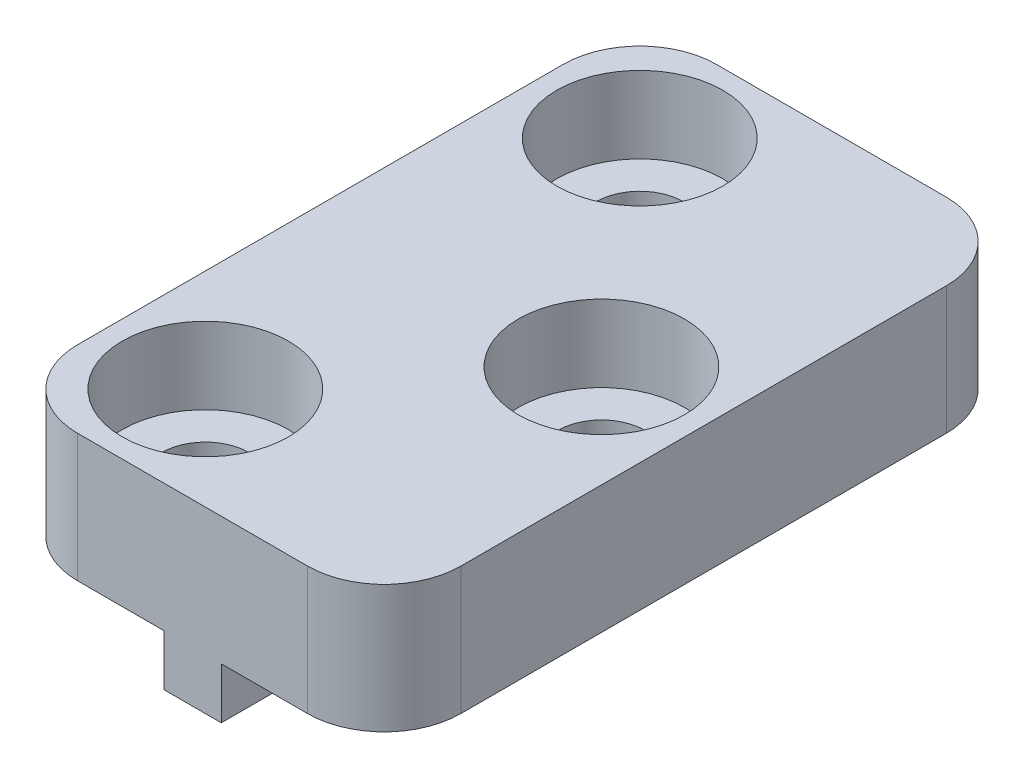
ISO-10303-21;
HEADER;
FILE_DESCRIPTION(('STEP AP214'),'2;1');
FILE_NAME('part.step','',(''),(''),'','','');
FILE_SCHEMA(('AUTOMOTIVE_DESIGN { 1 0 10303 214 1 1 1 1 }'));
ENDSEC;
DATA;
#1=APPLICATION_CONTEXT('core data for automotive mechanical design processes');
#2=APPLICATION_PROTOCOL_DEFINITION('international standard','automotive_design',2000,#1);
#3=PRODUCT_CONTEXT('',#1,'mechanical');
#4=PRODUCT('Part','Part','',(#3));
#5=PRODUCT_RELATED_PRODUCT_CATEGORY('part','',(#4));
#6=PRODUCT_DEFINITION_FORMATION('','',#4);
#7=PRODUCT_DEFINITION_CONTEXT('part definition',#1,'design');
#8=PRODUCT_DEFINITION('design','',#6,#7);
#9=PRODUCT_DEFINITION_SHAPE('','',#8);
#10=(LENGTH_UNIT() NAMED_UNIT(*) SI_UNIT(.MILLI.,.METRE.));
#11=(NAMED_UNIT(*) PLANE_ANGLE_UNIT() SI_UNIT($,.RADIAN.));
#12=(NAMED_UNIT(*) SI_UNIT($,.STERADIAN.) SOLID_ANGLE_UNIT());
#13=UNCERTAINTY_MEASURE_WITH_UNIT(LENGTH_MEASURE(1.E-05),#10,'distance_accuracy_value','');
#14=(GEOMETRIC_REPRESENTATION_CONTEXT(3) GLOBAL_UNCERTAINTY_ASSIGNED_CONTEXT((#13)) GLOBAL_UNIT_ASSIGNED_CONTEXT((#10,
#11,#12)) REPRESENTATION_CONTEXT('',''));
#15=CARTESIAN_POINT('',(0.,0.,0.));
#16=DIRECTION('',(0.,0.,1.));
#17=DIRECTION('',(1.,0.,0.));
#18=AXIS2_PLACEMENT_3D('',#15,#16,#17);
#19=CARTESIAN_POINT('',(0.,0.,0.));
#20=DIRECTION('',(0.,-1.,0.));
#21=DIRECTION('',(0.,0.,-1.));
#22=AXIS2_PLACEMENT_3D('',#19,#20,#21);
#23=PLANE('',#22);
#24=CARTESIAN_POINT('',(3.5,0.,0.));
#25=DIRECTION('',(0.,-1.,0.));
#26=DIRECTION('',(0.,0.,-1.));
#27=AXIS2_PLACEMENT_3D('',#24,#25,#26);
#28=CIRCLE('',#27,1.7);
#29=CARTESIAN_POINT('',(3.5,0.,-1.7));
#30=VERTEX_POINT('',#29);
#31=EDGE_CURVE('E275',#30,#30,#28,.T.);
#32=ORIENTED_EDGE('',*,*,#31,.F.);
#33=EDGE_LOOP('',(#32));
#34=FACE_BOUND('',#33,.T.);
#35=DIRECTION('',(-1.,0.,0.));
#36=VECTOR('',#35,1.);
#37=CARTESIAN_POINT('',(-7.5,0.,-12.5));
#38=LINE('',#37,#36);
#39=CARTESIAN_POINT('',(4.5,0.,-12.5));
#40=VERTEX_POINT('',#39);
#41=CARTESIAN_POINT('',(1.125,0.,-12.5));
#42=VERTEX_POINT('',#41);
#43=EDGE_CURVE('E150',#40,#42,#38,.T.);
#44=ORIENTED_EDGE('',*,*,#43,.F.);
#45=CARTESIAN_POINT('',(4.5,0.,-9.5));
#46=DIRECTION('',(0.,-1.,0.));
#47=DIRECTION('',(0.,0.,-1.));
#48=AXIS2_PLACEMENT_3D('',#45,#46,#47);
#49=CIRCLE('',#48,3.);
#50=CARTESIAN_POINT('',(7.5,0.,-9.5));
#51=VERTEX_POINT('',#50);
#52=EDGE_CURVE('E37',#40,#51,#49,.T.);
#53=ORIENTED_EDGE('',*,*,#52,.T.);
#54=DIRECTION('',(0.,0.,-1.));
#55=VECTOR('',#54,1.);
#56=CARTESIAN_POINT('',(7.5,0.,12.5));
#57=LINE('',#56,#55);
#58=CARTESIAN_POINT('',(7.5,0.,9.5));
#59=VERTEX_POINT('',#58);
#60=EDGE_CURVE('E128',#59,#51,#57,.T.);
#61=ORIENTED_EDGE('',*,*,#60,.F.);
#62=CARTESIAN_POINT('',(4.5,0.,9.5));
#63=DIRECTION('',(0.,-1.,0.));
#64=DIRECTION('',(0.,0.,-1.));
#65=AXIS2_PLACEMENT_3D('',#62,#63,#64);
#66=CIRCLE('',#65,3.);
#67=CARTESIAN_POINT('',(4.5,0.,12.5));
#68=VERTEX_POINT('',#67);
#69=EDGE_CURVE('E31',#59,#68,#66,.T.);
#70=ORIENTED_EDGE('',*,*,#69,.T.);
#71=DIRECTION('',(1.,0.,0.));
#72=VECTOR('',#71,1.);
#73=CARTESIAN_POINT('',(-7.5,0.,12.5));
#74=LINE('',#73,#72);
#75=CARTESIAN_POINT('',(1.125,0.,12.5));
#76=VERTEX_POINT('',#75);
#77=EDGE_CURVE('E155',#76,#68,#74,.T.);
#78=ORIENTED_EDGE('',*,*,#77,.F.);
#79=DIRECTION('',(0.,0.,1.));
#80=VECTOR('',#79,1.);
#81=CARTESIAN_POINT('',(1.125,0.,-12.5));
#82=LINE('',#81,#80);
#83=EDGE_CURVE('E127',#42,#76,#82,.T.);
#84=ORIENTED_EDGE('',*,*,#83,.F.);
#85=EDGE_LOOP('',(#44,#53,#61,#70,#78,#84));
#86=FACE_BOUND('',#85,.T.);
#87=ADVANCED_FACE('F16',(#34,#86),#23,.T.);
#88=CARTESIAN_POINT('',(7.5,4.99999999999999,12.5));
#89=DIRECTION('',(-1.,0.,0.));
#90=DIRECTION('',(0.,0.,1.));
#91=AXIS2_PLACEMENT_3D('',#88,#89,#90);
#92=PLANE('',#91);
#93=ORIENTED_EDGE('',*,*,#60,.T.);
#94=DIRECTION('',(0.,-1.,0.));
#95=VECTOR('',#94,1.);
#96=CARTESIAN_POINT('',(7.5,5.,-9.5));
#97=LINE('',#96,#95);
#98=CARTESIAN_POINT('',(7.5,5.,-9.5));
#99=VERTEX_POINT('',#98);
#100=EDGE_CURVE('E183',#51,#99,#97,.F.);
#101=ORIENTED_EDGE('',*,*,#100,.T.);
#102=DIRECTION('',(0.,0.,-1.));
#103=VECTOR('',#102,1.);
#104=CARTESIAN_POINT('',(7.5,4.99999999999999,12.5));
#105=LINE('',#104,#103);
#106=CARTESIAN_POINT('',(7.5,4.99999999999999,9.5));
#107=VERTEX_POINT('',#106);
#108=EDGE_CURVE('E136',#107,#99,#105,.T.);
#109=ORIENTED_EDGE('',*,*,#108,.F.);
#110=DIRECTION('',(0.,-1.,0.));
#111=VECTOR('',#110,1.);
#112=CARTESIAN_POINT('',(7.5,4.99999999999999,9.5));
#113=LINE('',#112,#111);
#114=EDGE_CURVE('E180',#107,#59,#113,.T.);
#115=ORIENTED_EDGE('',*,*,#114,.T.);
#116=EDGE_LOOP('',(#93,#101,#109,#115));
#117=FACE_BOUND('',#116,.T.);
#118=ADVANCED_FACE('F222',(#117),#92,.F.);
#119=CARTESIAN_POINT('',(-7.5,5.,-12.5));
#120=DIRECTION('',(0.,0.,1.));
#121=DIRECTION('',(1.,0.,0.));
#122=AXIS2_PLACEMENT_3D('',#119,#120,#121);
#123=PLANE('',#122);
#124=CARTESIAN_POINT('',(-1.125,0.,-12.5));
#125=VERTEX_POINT('',#124);
#126=CARTESIAN_POINT('',(-4.5,0.,-12.5));
#127=VERTEX_POINT('',#126);
#128=EDGE_CURVE('E130',#125,#127,#38,.T.);
#129=ORIENTED_EDGE('',*,*,#128,.T.);
#130=DIRECTION('',(0.,-1.,0.));
#131=VECTOR('',#130,1.);
#132=CARTESIAN_POINT('',(-4.5,5.,-12.5));
#133=LINE('',#132,#131);
#134=CARTESIAN_POINT('',(-4.5,5.,-12.5));
#135=VERTEX_POINT('',#134);
#136=EDGE_CURVE('E168',#127,#135,#133,.F.);
#137=ORIENTED_EDGE('',*,*,#136,.T.);
#138=DIRECTION('',(-1.,0.,0.));
#139=VECTOR('',#138,1.);
#140=CARTESIAN_POINT('',(-7.5,5.,-12.5));
#141=LINE('',#140,#139);
#142=CARTESIAN_POINT('',(4.5,5.,-12.5));
#143=VERTEX_POINT('',#142);
#144=EDGE_CURVE('E139',#143,#135,#141,.T.);
#145=ORIENTED_EDGE('',*,*,#144,.F.);
#146=DIRECTION('',(0.,-1.,0.));
#147=VECTOR('',#146,1.);
#148=CARTESIAN_POINT('',(4.5,5.,-12.5));
#149=LINE('',#148,#147);
#150=EDGE_CURVE('E165',#143,#40,#149,.T.);
#151=ORIENTED_EDGE('',*,*,#150,.T.);
#152=ORIENTED_EDGE('',*,*,#43,.T.);
#153=DIRECTION('',(0.,1.,0.));
#154=VECTOR('',#153,1.);
#155=CARTESIAN_POINT('',(1.125,-2.,-12.5));
#156=LINE('',#155,#154);
#157=CARTESIAN_POINT('',(1.125,-2.,-12.5));
#158=VERTEX_POINT('',#157);
#159=EDGE_CURVE('E202',#158,#42,#156,.T.);
#160=ORIENTED_EDGE('',*,*,#159,.F.);
#161=DIRECTION('',(1.,0.,0.));
#162=VECTOR('',#161,1.);
#163=CARTESIAN_POINT('',(-1.125,-2.,-12.5));
#164=LINE('',#163,#162);
#165=CARTESIAN_POINT('',(-1.125,-2.,-12.5));
#166=VERTEX_POINT('',#165);
#167=EDGE_CURVE('E119',#166,#158,#164,.T.);
#168=ORIENTED_EDGE('',*,*,#167,.F.);
#169=DIRECTION('',(0.,1.,0.));
#170=VECTOR('',#169,1.);
#171=CARTESIAN_POINT('',(-1.125,-2.,-12.5));
#172=LINE('',#171,#170);
#173=EDGE_CURVE('E132',#166,#125,#172,.T.);
#174=ORIENTED_EDGE('',*,*,#173,.T.);
#175=EDGE_LOOP('',(#129,#137,#145,#151,#152,#160,#168,#174));
#176=FACE_BOUND('',#175,.T.);
#177=ADVANCED_FACE('F208',(#176),#123,.F.);
#178=CARTESIAN_POINT('',(-7.5,5.,12.5));
#179=DIRECTION('',(1.,0.,0.));
#180=DIRECTION('',(0.,0.,-1.));
#181=AXIS2_PLACEMENT_3D('',#178,#179,#180);
#182=PLANE('',#181);
#183=DIRECTION('',(0.,0.,1.));
#184=VECTOR('',#183,1.);
#185=CARTESIAN_POINT('',(-7.5,5.,12.5));
#186=LINE('',#185,#184);
#187=CARTESIAN_POINT('',(-7.5,5.,-9.5));
#188=VERTEX_POINT('',#187);
#189=CARTESIAN_POINT('',(-7.5,5.,9.5));
#190=VERTEX_POINT('',#189);
#191=EDGE_CURVE('E143',#188,#190,#186,.T.);
#192=ORIENTED_EDGE('',*,*,#191,.F.);
#193=DIRECTION('',(0.,-1.,0.));
#194=VECTOR('',#193,1.);
#195=CARTESIAN_POINT('',(-7.5,5.,-9.5));
#196=LINE('',#195,#194);
#197=CARTESIAN_POINT('',(-7.5,0.,-9.5));
#198=VERTEX_POINT('',#197);
#199=EDGE_CURVE('E158',#188,#198,#196,.T.);
#200=ORIENTED_EDGE('',*,*,#199,.T.);
#201=DIRECTION('',(0.,0.,1.));
#202=VECTOR('',#201,1.);
#203=CARTESIAN_POINT('',(-7.5,0.,12.5));
#204=LINE('',#203,#202);
#205=CARTESIAN_POINT('',(-7.5,0.,9.5));
#206=VERTEX_POINT('',#205);
#207=EDGE_CURVE('E152',#198,#206,#204,.T.);
#208=ORIENTED_EDGE('',*,*,#207,.T.);
#209=DIRECTION('',(0.,-1.,0.));
#210=VECTOR('',#209,1.);
#211=CARTESIAN_POINT('',(-7.5,5.,9.5));
#212=LINE('',#211,#210);
#213=EDGE_CURVE('E148',#206,#190,#212,.F.);
#214=ORIENTED_EDGE('',*,*,#213,.T.);
#215=EDGE_LOOP('',(#192,#200,#208,#214));
#216=FACE_BOUND('',#215,.T.);
#217=ADVANCED_FACE('F232',(#216),#182,.F.);
#218=CARTESIAN_POINT('',(-7.5,5.,12.5));
#219=DIRECTION('',(0.,0.,-1.));
#220=DIRECTION('',(-1.,0.,0.));
#221=AXIS2_PLACEMENT_3D('',#218,#219,#220);
#222=PLANE('',#221);
#223=ORIENTED_EDGE('',*,*,#77,.T.);
#224=DIRECTION('',(0.,-1.,0.));
#225=VECTOR('',#224,1.);
#226=CARTESIAN_POINT('',(4.5,5.,12.5));
#227=LINE('',#226,#225);
#228=CARTESIAN_POINT('',(4.5,5.,12.5));
#229=VERTEX_POINT('',#228);
#230=EDGE_CURVE('E11',#68,#229,#227,.F.);
#231=ORIENTED_EDGE('',*,*,#230,.T.);
#232=DIRECTION('',(1.,0.,0.));
#233=VECTOR('',#232,1.);
#234=CARTESIAN_POINT('',(-7.5,5.,12.5));
#235=LINE('',#234,#233);
#236=CARTESIAN_POINT('',(-4.5,5.,12.5));
#237=VERTEX_POINT('',#236);
#238=EDGE_CURVE('E146',#237,#229,#235,.T.);
#239=ORIENTED_EDGE('',*,*,#238,.F.);
#240=DIRECTION('',(0.,-1.,0.));
#241=VECTOR('',#240,1.);
#242=CARTESIAN_POINT('',(-4.5,5.,12.5));
#243=LINE('',#242,#241);
#244=CARTESIAN_POINT('',(-4.5,0.,12.5));
#245=VERTEX_POINT('',#244);
#246=EDGE_CURVE('E24',#237,#245,#243,.T.);
#247=ORIENTED_EDGE('',*,*,#246,.T.);
#248=CARTESIAN_POINT('',(-1.125,0.,12.5));
#249=VERTEX_POINT('',#248);
#250=EDGE_CURVE('E140',#245,#249,#74,.T.);
#251=ORIENTED_EDGE('',*,*,#250,.T.);
#252=DIRECTION('',(0.,1.,0.));
#253=VECTOR('',#252,1.);
#254=CARTESIAN_POINT('',(-1.125,-2.,12.5));
#255=LINE('',#254,#253);
#256=CARTESIAN_POINT('',(-1.125,-2.,12.5));
#257=VERTEX_POINT('',#256);
#258=EDGE_CURVE('E110',#257,#249,#255,.T.);
#259=ORIENTED_EDGE('',*,*,#258,.F.);
#260=DIRECTION('',(-1.,0.,0.));
#261=VECTOR('',#260,1.);
#262=CARTESIAN_POINT('',(-1.125,-2.,12.5));
#263=LINE('',#262,#261);
#264=CARTESIAN_POINT('',(1.125,-2.,12.5));
#265=VERTEX_POINT('',#264);
#266=EDGE_CURVE('E103',#265,#257,#263,.T.);
#267=ORIENTED_EDGE('',*,*,#266,.F.);
#268=DIRECTION('',(0.,1.,0.));
#269=VECTOR('',#268,1.);
#270=CARTESIAN_POINT('',(1.125,-2.,12.5));
#271=LINE('',#270,#269);
#272=EDGE_CURVE('E107',#265,#76,#271,.T.);
#273=ORIENTED_EDGE('',*,*,#272,.T.);
#274=EDGE_LOOP('',(#223,#231,#239,#247,#251,#259,#267,#273));
#275=FACE_BOUND('',#274,.T.);
#276=ADVANCED_FACE('F105',(#275),#222,.F.);
#277=CARTESIAN_POINT('',(0.,5.,0.));
#278=DIRECTION('',(0.,-1.,0.));
#279=DIRECTION('',(0.,0.,-1.));
#280=AXIS2_PLACEMENT_3D('',#277,#278,#279);
#281=PLANE('',#280);
#282=CARTESIAN_POINT('',(-3.5,5.,-8.5));
#283=DIRECTION('',(0.,1.,0.));
#284=DIRECTION('',(0.,0.,1.));
#285=AXIS2_PLACEMENT_3D('',#282,#283,#284);
#286=CIRCLE('',#285,3.25);
#287=CARTESIAN_POINT('',(-3.5,5.,-5.25));
#288=VERTEX_POINT('',#287);
#289=EDGE_CURVE('E294',#288,#288,#286,.T.);
#290=ORIENTED_EDGE('',*,*,#289,.F.);
#291=EDGE_LOOP('',(#290));
#292=FACE_BOUND('',#291,.T.);
#293=CARTESIAN_POINT('',(3.5,5.,0.));
#294=DIRECTION('',(0.,1.,0.));
#295=DIRECTION('',(0.,0.,1.));
#296=AXIS2_PLACEMENT_3D('',#293,#294,#295);
#297=CIRCLE('',#296,3.25);
#298=CARTESIAN_POINT('',(3.5,5.,3.25));
#299=VERTEX_POINT('',#298);
#300=EDGE_CURVE('E284',#299,#299,#297,.T.);
#301=ORIENTED_EDGE('',*,*,#300,.F.);
#302=EDGE_LOOP('',(#301));
#303=FACE_BOUND('',#302,.T.);
#304=CARTESIAN_POINT('',(-3.5,5.,8.5));
#305=DIRECTION('',(0.,1.,0.));
#306=DIRECTION('',(0.,0.,1.));
#307=AXIS2_PLACEMENT_3D('',#304,#305,#306);
#308=CIRCLE('',#307,3.25);
#309=CARTESIAN_POINT('',(-3.5,5.,11.75));
#310=VERTEX_POINT('',#309);
#311=EDGE_CURVE('E272',#310,#310,#308,.T.);
#312=ORIENTED_EDGE('',*,*,#311,.F.);
#313=EDGE_LOOP('',(#312));
#314=FACE_BOUND('',#313,.T.);
#315=ORIENTED_EDGE('',*,*,#144,.T.);
#316=CARTESIAN_POINT('',(-4.5,5.,-9.5));
#317=DIRECTION('',(0.,-1.,0.));
#318=DIRECTION('',(0.,0.,-1.));
#319=AXIS2_PLACEMENT_3D('',#316,#317,#318);
#320=CIRCLE('',#319,3.);
#321=EDGE_CURVE('E176',#135,#188,#320,.F.);
#322=ORIENTED_EDGE('',*,*,#321,.T.);
#323=ORIENTED_EDGE('',*,*,#191,.T.);
#324=CARTESIAN_POINT('',(-4.5,5.,9.5));
#325=DIRECTION('',(0.,-1.,0.));
#326=DIRECTION('',(0.,0.,-1.));
#327=AXIS2_PLACEMENT_3D('',#324,#325,#326);
#328=CIRCLE('',#327,3.);
#329=EDGE_CURVE('E170',#190,#237,#328,.F.);
#330=ORIENTED_EDGE('',*,*,#329,.T.);
#331=ORIENTED_EDGE('',*,*,#238,.T.);
#332=CARTESIAN_POINT('',(4.5,5.,9.5));
#333=DIRECTION('',(0.,-1.,0.));
#334=DIRECTION('',(0.,0.,-1.));
#335=AXIS2_PLACEMENT_3D('',#332,#333,#334);
#336=CIRCLE('',#335,3.);
#337=EDGE_CURVE('E172',#229,#107,#336,.F.);
#338=ORIENTED_EDGE('',*,*,#337,.T.);
#339=ORIENTED_EDGE('',*,*,#108,.T.);
#340=CARTESIAN_POINT('',(4.5,5.,-9.5));
#341=DIRECTION('',(0.,-1.,0.));
#342=DIRECTION('',(0.,0.,-1.));
#343=AXIS2_PLACEMENT_3D('',#340,#341,#342);
#344=CIRCLE('',#343,3.);
#345=EDGE_CURVE('E174',#99,#143,#344,.F.);
#346=ORIENTED_EDGE('',*,*,#345,.T.);
#347=EDGE_LOOP('',(#315,#322,#323,#330,#331,#338,#339,#346));
#348=FACE_BOUND('',#347,.T.);
#349=ADVANCED_FACE('F219',(#292,#303,#314,#348),#281,.F.);
#350=CARTESIAN_POINT('',(-3.5,0.,-8.5));
#351=DIRECTION('',(0.,-1.,0.));
#352=DIRECTION('',(0.,0.,-1.));
#353=AXIS2_PLACEMENT_3D('',#350,#351,#352);
#354=CIRCLE('',#353,1.7);
#355=CARTESIAN_POINT('',(-3.5,0.,-10.2));
#356=VERTEX_POINT('',#355);
#357=EDGE_CURVE('E260',#356,#356,#354,.T.);
#358=ORIENTED_EDGE('',*,*,#357,.F.);
#359=EDGE_LOOP('',(#358));
#360=FACE_BOUND('',#359,.T.);
#361=CARTESIAN_POINT('',(-3.5,0.,8.5));
#362=DIRECTION('',(0.,-1.,0.));
#363=DIRECTION('',(0.,0.,-1.));
#364=AXIS2_PLACEMENT_3D('',#361,#362,#363);
#365=CIRCLE('',#364,1.7);
#366=CARTESIAN_POINT('',(-3.5,0.,6.8));
#367=VERTEX_POINT('',#366);
#368=EDGE_CURVE('E205',#367,#367,#365,.T.);
#369=ORIENTED_EDGE('',*,*,#368,.F.);
#370=EDGE_LOOP('',(#369));
#371=FACE_BOUND('',#370,.T.);
#372=ORIENTED_EDGE('',*,*,#207,.F.);
#373=CARTESIAN_POINT('',(-4.5,0.,-9.5));
#374=DIRECTION('',(0.,-1.,0.));
#375=DIRECTION('',(0.,0.,-1.));
#376=AXIS2_PLACEMENT_3D('',#373,#374,#375);
#377=CIRCLE('',#376,3.);
#378=EDGE_CURVE('E163',#198,#127,#377,.T.);
#379=ORIENTED_EDGE('',*,*,#378,.T.);
#380=ORIENTED_EDGE('',*,*,#128,.F.);
#381=DIRECTION('',(0.,0.,-1.));
#382=VECTOR('',#381,1.);
#383=CARTESIAN_POINT('',(-1.125,0.,-12.5));
#384=LINE('',#383,#382);
#385=EDGE_CURVE('E123',#249,#125,#384,.T.);
#386=ORIENTED_EDGE('',*,*,#385,.F.);
#387=ORIENTED_EDGE('',*,*,#250,.F.);
#388=CARTESIAN_POINT('',(-4.5,0.,9.5));
#389=DIRECTION('',(0.,-1.,0.));
#390=DIRECTION('',(0.,0.,-1.));
#391=AXIS2_PLACEMENT_3D('',#388,#389,#390);
#392=CIRCLE('',#391,3.);
#393=EDGE_CURVE('E161',#245,#206,#392,.T.);
#394=ORIENTED_EDGE('',*,*,#393,.T.);
#395=EDGE_LOOP('',(#372,#379,#380,#386,#387,#394));
#396=FACE_BOUND('',#395,.T.);
#397=ADVANCED_FACE('F193',(#360,#371,#396),#23,.T.);
#398=CARTESIAN_POINT('',(1.125,-2.,-12.5));
#399=DIRECTION('',(-1.,0.,0.));
#400=DIRECTION('',(0.,0.,1.));
#401=AXIS2_PLACEMENT_3D('',#398,#399,#400);
#402=PLANE('',#401);
#403=ORIENTED_EDGE('',*,*,#83,.T.);
#404=ORIENTED_EDGE('',*,*,#272,.F.);
#405=DIRECTION('',(0.,0.,1.));
#406=VECTOR('',#405,1.);
#407=CARTESIAN_POINT('',(1.125,-2.,-12.5));
#408=LINE('',#407,#406);
#409=EDGE_CURVE('E114',#158,#265,#408,.T.);
#410=ORIENTED_EDGE('',*,*,#409,.F.);
#411=ORIENTED_EDGE('',*,*,#159,.T.);
#412=EDGE_LOOP('',(#403,#404,#410,#411));
#413=FACE_BOUND('',#412,.T.);
#414=ADVANCED_FACE('F125',(#413),#402,.F.);
#415=CARTESIAN_POINT('',(-1.125,-2.,-12.5));
#416=DIRECTION('',(1.,0.,0.));
#417=DIRECTION('',(0.,0.,-1.));
#418=AXIS2_PLACEMENT_3D('',#415,#416,#417);
#419=PLANE('',#418);
#420=ORIENTED_EDGE('',*,*,#385,.T.);
#421=ORIENTED_EDGE('',*,*,#173,.F.);
#422=DIRECTION('',(0.,0.,-1.));
#423=VECTOR('',#422,1.);
#424=CARTESIAN_POINT('',(-1.125,-2.,-12.5));
#425=LINE('',#424,#423);
#426=EDGE_CURVE('E113',#257,#166,#425,.T.);
#427=ORIENTED_EDGE('',*,*,#426,.F.);
#428=ORIENTED_EDGE('',*,*,#258,.T.);
#429=EDGE_LOOP('',(#420,#421,#427,#428));
#430=FACE_BOUND('',#429,.T.);
#431=ADVANCED_FACE('F200',(#430),#419,.F.);
#432=CARTESIAN_POINT('',(0.,-2.,0.));
#433=DIRECTION('',(0.,1.,0.));
#434=DIRECTION('',(0.,0.,1.));
#435=AXIS2_PLACEMENT_3D('',#432,#433,#434);
#436=PLANE('',#435);
#437=ORIENTED_EDGE('',*,*,#409,.T.);
#438=ORIENTED_EDGE('',*,*,#266,.T.);
#439=ORIENTED_EDGE('',*,*,#426,.T.);
#440=ORIENTED_EDGE('',*,*,#167,.T.);
#441=EDGE_LOOP('',(#437,#438,#439,#440));
#442=FACE_BOUND('',#441,.T.);
#443=ADVANCED_FACE('F117',(#442),#436,.F.);
#444=CARTESIAN_POINT('',(-3.5,5.,8.5));
#445=DIRECTION('',(0.,1.,0.));
#446=DIRECTION('',(0.,0.,1.));
#447=AXIS2_PLACEMENT_3D('',#444,#445,#446);
#448=CYLINDRICAL_SURFACE('',#447,1.7);
#449=CARTESIAN_POINT('',(-3.5,2.,8.5));
#450=DIRECTION('',(0.,1.,0.));
#451=DIRECTION('',(0.,0.,1.));
#452=AXIS2_PLACEMENT_3D('',#449,#450,#451);
#453=CIRCLE('',#452,1.7);
#454=CARTESIAN_POINT('',(-3.5,2.,10.2));
#455=VERTEX_POINT('',#454);
#456=EDGE_CURVE('E264',#455,#455,#453,.T.);
#457=ORIENTED_EDGE('',*,*,#456,.T.);
#458=EDGE_LOOP('',(#457));
#459=FACE_BOUND('',#458,.T.);
#460=ORIENTED_EDGE('',*,*,#368,.T.);
#461=EDGE_LOOP('',(#460));
#462=FACE_BOUND('',#461,.T.);
#463=ADVANCED_FACE('F317',(#459,#462),#448,.F.);
#464=CARTESIAN_POINT('',(-1.8,2.,8.5));
#465=DIRECTION('',(0.,-1.,0.));
#466=DIRECTION('',(0.,0.,-1.));
#467=AXIS2_PLACEMENT_3D('',#464,#465,#466);
#468=PLANE('',#467);
#469=ORIENTED_EDGE('',*,*,#456,.F.);
#470=EDGE_LOOP('',(#469));
#471=FACE_BOUND('',#470,.T.);
#472=CARTESIAN_POINT('',(-3.5,2.,8.5));
#473=DIRECTION('',(0.,1.,0.));
#474=DIRECTION('',(0.,0.,1.));
#475=AXIS2_PLACEMENT_3D('',#472,#473,#474);
#476=CIRCLE('',#475,3.25);
#477=CARTESIAN_POINT('',(-3.5,2.,11.75));
#478=VERTEX_POINT('',#477);
#479=EDGE_CURVE('E267',#478,#478,#476,.T.);
#480=ORIENTED_EDGE('',*,*,#479,.T.);
#481=EDGE_LOOP('',(#480));
#482=FACE_BOUND('',#481,.T.);
#483=ADVANCED_FACE('F307',(#471,#482),#468,.F.);
#484=CARTESIAN_POINT('',(-3.5,5.,8.5));
#485=DIRECTION('',(0.,1.,0.));
#486=DIRECTION('',(0.,0.,1.));
#487=AXIS2_PLACEMENT_3D('',#484,#485,#486);
#488=CYLINDRICAL_SURFACE('',#487,3.25);
#489=ORIENTED_EDGE('',*,*,#479,.F.);
#490=EDGE_LOOP('',(#489));
#491=FACE_BOUND('',#490,.T.);
#492=ORIENTED_EDGE('',*,*,#311,.T.);
#493=EDGE_LOOP('',(#492));
#494=FACE_BOUND('',#493,.T.);
#495=ADVANCED_FACE('F304',(#491,#494),#488,.F.);
#496=CARTESIAN_POINT('',(3.5,5.,0.));
#497=DIRECTION('',(0.,1.,0.));
#498=DIRECTION('',(0.,0.,1.));
#499=AXIS2_PLACEMENT_3D('',#496,#497,#498);
#500=CYLINDRICAL_SURFACE('',#499,1.7);
#501=CARTESIAN_POINT('',(3.5,2.,0.));
#502=DIRECTION('',(0.,1.,0.));
#503=DIRECTION('',(0.,0.,1.));
#504=AXIS2_PLACEMENT_3D('',#501,#502,#503);
#505=CIRCLE('',#504,1.7);
#506=CARTESIAN_POINT('',(3.5,2.,1.7));
#507=VERTEX_POINT('',#506);
#508=EDGE_CURVE('E278',#507,#507,#505,.T.);
#509=ORIENTED_EDGE('',*,*,#508,.T.);
#510=EDGE_LOOP('',(#509));
#511=FACE_BOUND('',#510,.T.);
#512=ORIENTED_EDGE('',*,*,#31,.T.);
#513=EDGE_LOOP('',(#512));
#514=FACE_BOUND('',#513,.T.);
#515=ADVANCED_FACE('F306',(#511,#514),#500,.F.);
#516=CARTESIAN_POINT('',(5.2,2.,0.));
#517=DIRECTION('',(0.,-1.,0.));
#518=DIRECTION('',(0.,0.,-1.));
#519=AXIS2_PLACEMENT_3D('',#516,#517,#518);
#520=PLANE('',#519);
#521=ORIENTED_EDGE('',*,*,#508,.F.);
#522=EDGE_LOOP('',(#521));
#523=FACE_BOUND('',#522,.T.);
#524=CARTESIAN_POINT('',(3.5,2.,0.));
#525=DIRECTION('',(0.,1.,0.));
#526=DIRECTION('',(0.,0.,1.));
#527=AXIS2_PLACEMENT_3D('',#524,#525,#526);
#528=CIRCLE('',#527,3.25);
#529=CARTESIAN_POINT('',(3.5,2.,3.25));
#530=VERTEX_POINT('',#529);
#531=EDGE_CURVE('E281',#530,#530,#528,.T.);
#532=ORIENTED_EDGE('',*,*,#531,.T.);
#533=EDGE_LOOP('',(#532));
#534=FACE_BOUND('',#533,.T.);
#535=ADVANCED_FACE('F314',(#523,#534),#520,.F.);
#536=CARTESIAN_POINT('',(3.5,5.,0.));
#537=DIRECTION('',(0.,1.,0.));
#538=DIRECTION('',(0.,0.,1.));
#539=AXIS2_PLACEMENT_3D('',#536,#537,#538);
#540=CYLINDRICAL_SURFACE('',#539,3.25);
#541=ORIENTED_EDGE('',*,*,#531,.F.);
#542=EDGE_LOOP('',(#541));
#543=FACE_BOUND('',#542,.T.);
#544=ORIENTED_EDGE('',*,*,#300,.T.);
#545=EDGE_LOOP('',(#544));
#546=FACE_BOUND('',#545,.T.);
#547=ADVANCED_FACE('F374',(#543,#546),#540,.F.);
#548=CARTESIAN_POINT('',(-3.5,5.,-8.5));
#549=DIRECTION('',(0.,1.,0.));
#550=DIRECTION('',(0.,0.,1.));
#551=AXIS2_PLACEMENT_3D('',#548,#549,#550);
#552=CYLINDRICAL_SURFACE('',#551,1.7);
#553=CARTESIAN_POINT('',(-3.5,2.,-8.5));
#554=DIRECTION('',(0.,1.,0.));
#555=DIRECTION('',(0.,0.,1.));
#556=AXIS2_PLACEMENT_3D('',#553,#554,#555);
#557=CIRCLE('',#556,1.7);
#558=CARTESIAN_POINT('',(-3.5,2.,-6.8));
#559=VERTEX_POINT('',#558);
#560=EDGE_CURVE('E288',#559,#559,#557,.T.);
#561=ORIENTED_EDGE('',*,*,#560,.T.);
#562=EDGE_LOOP('',(#561));
#563=FACE_BOUND('',#562,.T.);
#564=ORIENTED_EDGE('',*,*,#357,.T.);
#565=EDGE_LOOP('',(#564));
#566=FACE_BOUND('',#565,.T.);
#567=ADVANCED_FACE('F383',(#563,#566),#552,.F.);
#568=CARTESIAN_POINT('',(-1.8,2.,-8.5));
#569=DIRECTION('',(0.,-1.,0.));
#570=DIRECTION('',(0.,0.,-1.));
#571=AXIS2_PLACEMENT_3D('',#568,#569,#570);
#572=PLANE('',#571);
#573=ORIENTED_EDGE('',*,*,#560,.F.);
#574=EDGE_LOOP('',(#573));
#575=FACE_BOUND('',#574,.T.);
#576=CARTESIAN_POINT('',(-3.5,2.,-8.5));
#577=DIRECTION('',(0.,1.,0.));
#578=DIRECTION('',(0.,0.,1.));
#579=AXIS2_PLACEMENT_3D('',#576,#577,#578);
#580=CIRCLE('',#579,3.25);
#581=CARTESIAN_POINT('',(-3.5,2.,-5.25));
#582=VERTEX_POINT('',#581);
#583=EDGE_CURVE('E291',#582,#582,#580,.T.);
#584=ORIENTED_EDGE('',*,*,#583,.T.);
#585=EDGE_LOOP('',(#584));
#586=FACE_BOUND('',#585,.T.);
#587=ADVANCED_FACE('F393',(#575,#586),#572,.F.);
#588=CARTESIAN_POINT('',(-3.5,5.,-8.5));
#589=DIRECTION('',(0.,1.,0.));
#590=DIRECTION('',(0.,0.,1.));
#591=AXIS2_PLACEMENT_3D('',#588,#589,#590);
#592=CYLINDRICAL_SURFACE('',#591,3.25);
#593=ORIENTED_EDGE('',*,*,#583,.F.);
#594=EDGE_LOOP('',(#593));
#595=FACE_BOUND('',#594,.T.);
#596=ORIENTED_EDGE('',*,*,#289,.T.);
#597=EDGE_LOOP('',(#596));
#598=FACE_BOUND('',#597,.T.);
#599=ADVANCED_FACE('F298',(#595,#598),#592,.F.);
#600=CARTESIAN_POINT('',(-4.5,5.,-9.5));
#601=DIRECTION('',(0.,-1.,0.));
#602=DIRECTION('',(0.,0.,-1.));
#603=AXIS2_PLACEMENT_3D('',#600,#601,#602);
#604=CYLINDRICAL_SURFACE('',#603,3.);
#605=ORIENTED_EDGE('',*,*,#321,.F.);
#606=ORIENTED_EDGE('',*,*,#136,.F.);
#607=ORIENTED_EDGE('',*,*,#378,.F.);
#608=ORIENTED_EDGE('',*,*,#199,.F.);
#609=EDGE_LOOP('',(#605,#606,#607,#608));
#610=FACE_BOUND('',#609,.T.);
#611=ADVANCED_FACE('F228',(#610),#604,.T.);
#612=CARTESIAN_POINT('',(4.5,5.,-9.5));
#613=DIRECTION('',(0.,-1.,0.));
#614=DIRECTION('',(0.,0.,-1.));
#615=AXIS2_PLACEMENT_3D('',#612,#613,#614);
#616=CYLINDRICAL_SURFACE('',#615,3.);
#617=ORIENTED_EDGE('',*,*,#345,.F.);
#618=ORIENTED_EDGE('',*,*,#100,.F.);
#619=ORIENTED_EDGE('',*,*,#52,.F.);
#620=ORIENTED_EDGE('',*,*,#150,.F.);
#621=EDGE_LOOP('',(#617,#618,#619,#620));
#622=FACE_BOUND('',#621,.T.);
#623=ADVANCED_FACE('F225',(#622),#616,.T.);
#624=CARTESIAN_POINT('',(4.5,5.,9.5));
#625=DIRECTION('',(0.,-1.,0.));
#626=DIRECTION('',(0.,0.,-1.));
#627=AXIS2_PLACEMENT_3D('',#624,#625,#626);
#628=CYLINDRICAL_SURFACE('',#627,3.);
#629=ORIENTED_EDGE('',*,*,#337,.F.);
#630=ORIENTED_EDGE('',*,*,#230,.F.);
#631=ORIENTED_EDGE('',*,*,#69,.F.);
#632=ORIENTED_EDGE('',*,*,#114,.F.);
#633=EDGE_LOOP('',(#629,#630,#631,#632));
#634=FACE_BOUND('',#633,.T.);
#635=ADVANCED_FACE('F215',(#634),#628,.T.);
#636=CARTESIAN_POINT('',(-4.5,5.,9.5));
#637=DIRECTION('',(0.,-1.,0.));
#638=DIRECTION('',(0.,0.,-1.));
#639=AXIS2_PLACEMENT_3D('',#636,#637,#638);
#640=CYLINDRICAL_SURFACE('',#639,3.);
#641=ORIENTED_EDGE('',*,*,#329,.F.);
#642=ORIENTED_EDGE('',*,*,#213,.F.);
#643=ORIENTED_EDGE('',*,*,#393,.F.);
#644=ORIENTED_EDGE('',*,*,#246,.F.);
#645=EDGE_LOOP('',(#641,#642,#643,#644));
#646=FACE_BOUND('',#645,.T.);
#647=ADVANCED_FACE('F18',(#646),#640,.T.);
#648=CLOSED_SHELL('',(#87,#118,#177,#217,#276,#349,#397,#414,#431,#443,#463,#483,#495,#515,#535,
#547,#567,#587,#599,#611,#623,#635,#647));
#649=MANIFOLD_SOLID_BREP('B1',#648);
#650=ADVANCED_BREP_SHAPE_REPRESENTATION('',(#18,#649),#14);
#651=SHAPE_DEFINITION_REPRESENTATION(#9,#650);
ENDSEC;
END-ISO-10303-21;
